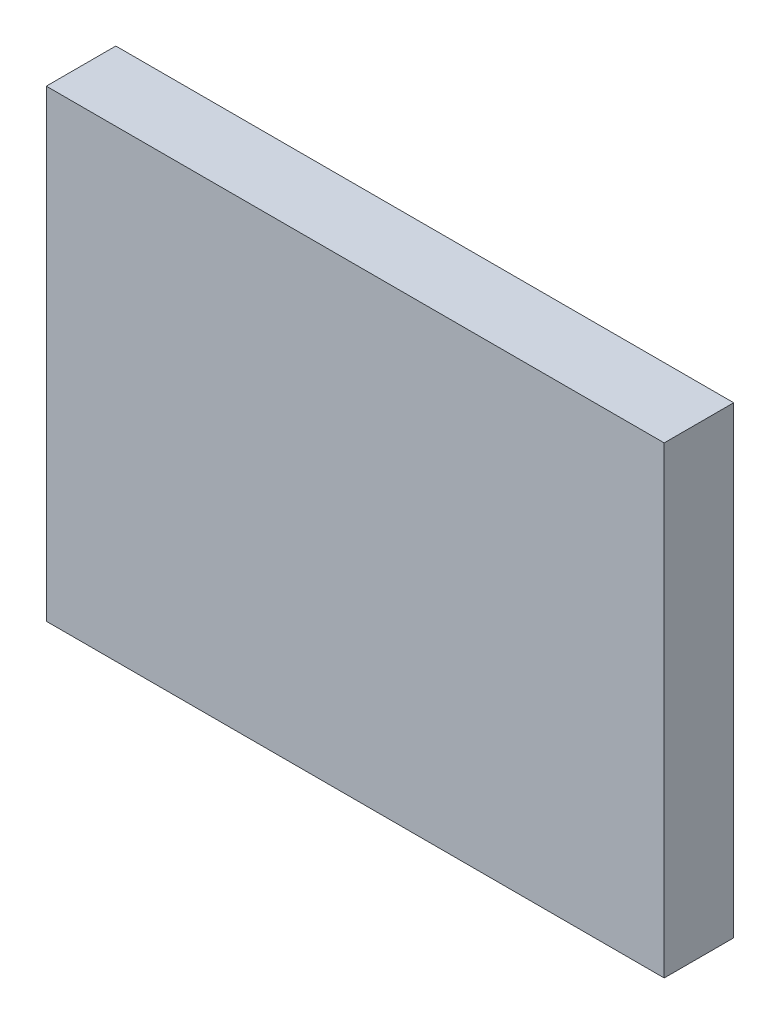
ISO-10303-21;
HEADER;
FILE_DESCRIPTION(('STEP AP214'),'2;1');
FILE_NAME('part.step','',(''),(''),'','','');
FILE_SCHEMA(('AUTOMOTIVE_DESIGN { 1 0 10303 214 1 1 1 1 }'));
ENDSEC;
DATA;
#1=APPLICATION_CONTEXT('core data for automotive mechanical design processes');
#2=APPLICATION_PROTOCOL_DEFINITION('international standard','automotive_design',2000,#1);
#3=PRODUCT_CONTEXT('',#1,'mechanical');
#4=PRODUCT('Part','Part','',(#3));
#5=PRODUCT_RELATED_PRODUCT_CATEGORY('part','',(#4));
#6=PRODUCT_DEFINITION_FORMATION('','',#4);
#7=PRODUCT_DEFINITION_CONTEXT('part definition',#1,'design');
#8=PRODUCT_DEFINITION('design','',#6,#7);
#9=PRODUCT_DEFINITION_SHAPE('','',#8);
#10=(LENGTH_UNIT() NAMED_UNIT(*) SI_UNIT(.MILLI.,.METRE.));
#11=(NAMED_UNIT(*) PLANE_ANGLE_UNIT() SI_UNIT($,.RADIAN.));
#12=(NAMED_UNIT(*) SI_UNIT($,.STERADIAN.) SOLID_ANGLE_UNIT());
#13=UNCERTAINTY_MEASURE_WITH_UNIT(LENGTH_MEASURE(1.E-05),#10,'distance_accuracy_value','');
#14=(GEOMETRIC_REPRESENTATION_CONTEXT(3) GLOBAL_UNCERTAINTY_ASSIGNED_CONTEXT((#13)) GLOBAL_UNIT_ASSIGNED_CONTEXT((#10,
#11,#12)) REPRESENTATION_CONTEXT('',''));
#15=CARTESIAN_POINT('',(0.,0.,0.));
#16=DIRECTION('',(0.,0.,1.));
#17=DIRECTION('',(1.,0.,0.));
#18=AXIS2_PLACEMENT_3D('',#15,#16,#17);
#19=CARTESIAN_POINT('',(80.,60.,18.));
#20=DIRECTION('',(-1.,0.,0.));
#21=DIRECTION('',(0.,-1.,0.));
#22=AXIS2_PLACEMENT_3D('',#19,#20,#21);
#23=PLANE('',#22);
#24=DIRECTION('',(0.,1.,0.));
#25=VECTOR('',#24,1.);
#26=CARTESIAN_POINT('',(80.,60.,0.));
#27=LINE('',#26,#25);
#28=CARTESIAN_POINT('',(80.,-60.,0.));
#29=VERTEX_POINT('',#28);
#30=CARTESIAN_POINT('',(80.,60.,0.));
#31=VERTEX_POINT('',#30);
#32=EDGE_CURVE('E96',#29,#31,#27,.T.);
#33=ORIENTED_EDGE('',*,*,#32,.T.);
#34=DIRECTION('',(0.,0.,-1.));
#35=VECTOR('',#34,1.);
#36=CARTESIAN_POINT('',(80.,60.,18.));
#37=LINE('',#36,#35);
#38=CARTESIAN_POINT('',(80.,60.,18.));
#39=VERTEX_POINT('',#38);
#40=EDGE_CURVE('E11',#39,#31,#37,.T.);
#41=ORIENTED_EDGE('',*,*,#40,.F.);
#42=DIRECTION('',(0.,1.,0.));
#43=VECTOR('',#42,1.);
#44=CARTESIAN_POINT('',(80.,60.,18.));
#45=LINE('',#44,#43);
#46=CARTESIAN_POINT('',(80.,-60.,18.));
#47=VERTEX_POINT('',#46);
#48=EDGE_CURVE('E84',#47,#39,#45,.T.);
#49=ORIENTED_EDGE('',*,*,#48,.F.);
#50=DIRECTION('',(0.,0.,-1.));
#51=VECTOR('',#50,1.);
#52=CARTESIAN_POINT('',(80.,-60.,18.));
#53=LINE('',#52,#51);
#54=EDGE_CURVE('E92',#47,#29,#53,.T.);
#55=ORIENTED_EDGE('',*,*,#54,.T.);
#56=EDGE_LOOP('',(#33,#41,#49,#55));
#57=FACE_BOUND('',#56,.T.);
#58=ADVANCED_FACE('F33',(#57),#23,.F.);
#59=CARTESIAN_POINT('',(-80.,60.,18.));
#60=DIRECTION('',(0.,-1.,0.));
#61=DIRECTION('',(0.,0.,-1.));
#62=AXIS2_PLACEMENT_3D('',#59,#60,#61);
#63=PLANE('',#62);
#64=DIRECTION('',(-1.,0.,0.));
#65=VECTOR('',#64,1.);
#66=CARTESIAN_POINT('',(-80.,60.,0.));
#67=LINE('',#66,#65);
#68=CARTESIAN_POINT('',(-80.,60.,0.));
#69=VERTEX_POINT('',#68);
#70=EDGE_CURVE('E88',#31,#69,#67,.T.);
#71=ORIENTED_EDGE('',*,*,#70,.T.);
#72=DIRECTION('',(0.,0.,-1.));
#73=VECTOR('',#72,1.);
#74=CARTESIAN_POINT('',(-80.,60.,18.));
#75=LINE('',#74,#73);
#76=CARTESIAN_POINT('',(-80.,60.,18.));
#77=VERTEX_POINT('',#76);
#78=EDGE_CURVE('E41',#77,#69,#75,.T.);
#79=ORIENTED_EDGE('',*,*,#78,.F.);
#80=DIRECTION('',(-1.,0.,0.));
#81=VECTOR('',#80,1.);
#82=CARTESIAN_POINT('',(-80.,60.,18.));
#83=LINE('',#82,#81);
#84=EDGE_CURVE('E79',#39,#77,#83,.T.);
#85=ORIENTED_EDGE('',*,*,#84,.F.);
#86=ORIENTED_EDGE('',*,*,#40,.T.);
#87=EDGE_LOOP('',(#71,#79,#85,#86));
#88=FACE_BOUND('',#87,.T.);
#89=ADVANCED_FACE('F87',(#88),#63,.F.);
#90=CARTESIAN_POINT('',(-80.,60.,18.));
#91=DIRECTION('',(1.,0.,0.));
#92=DIRECTION('',(0.,1.,0.));
#93=AXIS2_PLACEMENT_3D('',#90,#91,#92);
#94=PLANE('',#93);
#95=DIRECTION('',(0.,-1.,0.));
#96=VECTOR('',#95,1.);
#97=CARTESIAN_POINT('',(-80.,60.,0.));
#98=LINE('',#97,#96);
#99=CARTESIAN_POINT('',(-80.,-60.,0.));
#100=VERTEX_POINT('',#99);
#101=EDGE_CURVE('E66',#69,#100,#98,.T.);
#102=ORIENTED_EDGE('',*,*,#101,.T.);
#103=DIRECTION('',(0.,0.,-1.));
#104=VECTOR('',#103,1.);
#105=CARTESIAN_POINT('',(-80.,-60.,18.));
#106=LINE('',#105,#104);
#107=CARTESIAN_POINT('',(-80.,-60.,18.));
#108=VERTEX_POINT('',#107);
#109=EDGE_CURVE('E89',#108,#100,#106,.T.);
#110=ORIENTED_EDGE('',*,*,#109,.F.);
#111=DIRECTION('',(0.,-1.,0.));
#112=VECTOR('',#111,1.);
#113=CARTESIAN_POINT('',(-80.,60.,18.));
#114=LINE('',#113,#112);
#115=EDGE_CURVE('E82',#77,#108,#114,.T.);
#116=ORIENTED_EDGE('',*,*,#115,.F.);
#117=ORIENTED_EDGE('',*,*,#78,.T.);
#118=EDGE_LOOP('',(#102,#110,#116,#117));
#119=FACE_BOUND('',#118,.T.);
#120=ADVANCED_FACE('F90',(#119),#94,.F.);
#121=CARTESIAN_POINT('',(-80.,-60.,18.));
#122=DIRECTION('',(0.,1.,0.));
#123=DIRECTION('',(0.,0.,1.));
#124=AXIS2_PLACEMENT_3D('',#121,#122,#123);
#125=PLANE('',#124);
#126=DIRECTION('',(1.,0.,0.));
#127=VECTOR('',#126,1.);
#128=CARTESIAN_POINT('',(-80.,-60.,0.));
#129=LINE('',#128,#127);
#130=EDGE_CURVE('E72',#100,#29,#129,.T.);
#131=ORIENTED_EDGE('',*,*,#130,.T.);
#132=ORIENTED_EDGE('',*,*,#54,.F.);
#133=DIRECTION('',(1.,0.,0.));
#134=VECTOR('',#133,1.);
#135=CARTESIAN_POINT('',(-80.,-60.,18.));
#136=LINE('',#135,#134);
#137=EDGE_CURVE('E49',#108,#47,#136,.T.);
#138=ORIENTED_EDGE('',*,*,#137,.F.);
#139=ORIENTED_EDGE('',*,*,#109,.T.);
#140=EDGE_LOOP('',(#131,#132,#138,#139));
#141=FACE_BOUND('',#140,.T.);
#142=ADVANCED_FACE('F103',(#141),#125,.F.);
#143=CARTESIAN_POINT('',(0.,0.,18.));
#144=DIRECTION('',(0.,0.,1.));
#145=DIRECTION('',(1.,0.,0.));
#146=AXIS2_PLACEMENT_3D('',#143,#144,#145);
#147=PLANE('',#146);
#148=ORIENTED_EDGE('',*,*,#48,.T.);
#149=ORIENTED_EDGE('',*,*,#84,.T.);
#150=ORIENTED_EDGE('',*,*,#115,.T.);
#151=ORIENTED_EDGE('',*,*,#137,.T.);
#152=EDGE_LOOP('',(#148,#149,#150,#151));
#153=FACE_BOUND('',#152,.T.);
#154=ADVANCED_FACE('F80',(#153),#147,.T.);
#155=CARTESIAN_POINT('',(0.,0.,0.));
#156=DIRECTION('',(0.,0.,1.));
#157=DIRECTION('',(1.,0.,0.));
#158=AXIS2_PLACEMENT_3D('',#155,#156,#157);
#159=PLANE('',#158);
#160=ORIENTED_EDGE('',*,*,#32,.F.);
#161=ORIENTED_EDGE('',*,*,#130,.F.);
#162=ORIENTED_EDGE('',*,*,#101,.F.);
#163=ORIENTED_EDGE('',*,*,#70,.F.);
#164=EDGE_LOOP('',(#160,#161,#162,#163));
#165=FACE_BOUND('',#164,.T.);
#166=ADVANCED_FACE('F106',(#165),#159,.F.);
#167=CLOSED_SHELL('',(#58,#89,#120,#142,#154,#166));
#168=MANIFOLD_SOLID_BREP('B2',#167);
#169=ADVANCED_BREP_SHAPE_REPRESENTATION('',(#18,#168),#14);
#170=SHAPE_DEFINITION_REPRESENTATION(#9,#169);
ENDSEC;
END-ISO-10303-21;
